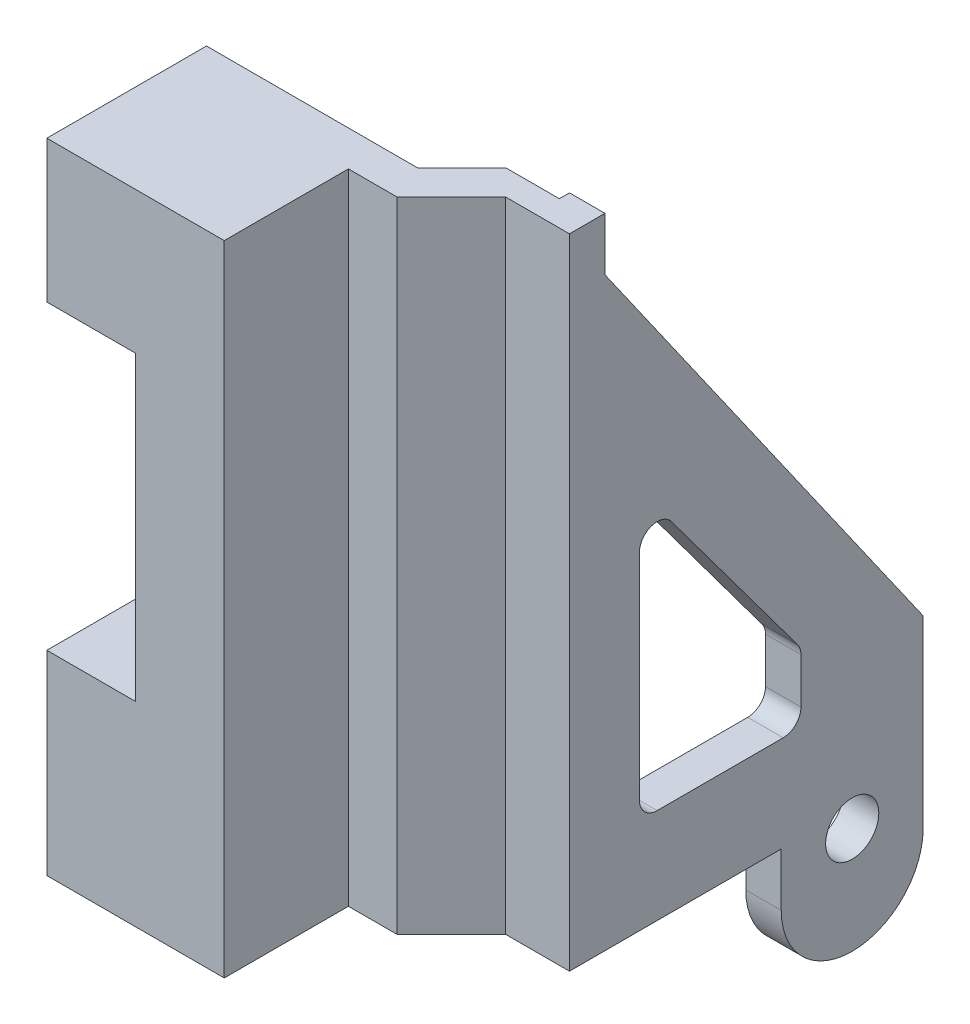
ISO-10303-21;
HEADER;
FILE_DESCRIPTION(('STEP AP214'),'2;1');
FILE_NAME('part.step','',(''),(''),'','','');
FILE_SCHEMA(('AUTOMOTIVE_DESIGN { 1 0 10303 214 1 1 1 1 }'));
ENDSEC;
DATA;
#1=APPLICATION_CONTEXT('core data for automotive mechanical design processes');
#2=APPLICATION_PROTOCOL_DEFINITION('international standard','automotive_design',2000,#1);
#3=PRODUCT_CONTEXT('',#1,'mechanical');
#4=PRODUCT('Part','Part','',(#3));
#5=PRODUCT_RELATED_PRODUCT_CATEGORY('part','',(#4));
#6=PRODUCT_DEFINITION_FORMATION('','',#4);
#7=PRODUCT_DEFINITION_CONTEXT('part definition',#1,'design');
#8=PRODUCT_DEFINITION('design','',#6,#7);
#9=PRODUCT_DEFINITION_SHAPE('','',#8);
#10=(LENGTH_UNIT() NAMED_UNIT(*) SI_UNIT(.MILLI.,.METRE.));
#11=(NAMED_UNIT(*) PLANE_ANGLE_UNIT() SI_UNIT($,.RADIAN.));
#12=(NAMED_UNIT(*) SI_UNIT($,.STERADIAN.) SOLID_ANGLE_UNIT());
#13=UNCERTAINTY_MEASURE_WITH_UNIT(LENGTH_MEASURE(1.E-05),#10,'distance_accuracy_value','');
#14=(GEOMETRIC_REPRESENTATION_CONTEXT(3) GLOBAL_UNCERTAINTY_ASSIGNED_CONTEXT((#13)) GLOBAL_UNIT_ASSIGNED_CONTEXT((#10,
#11,#12)) REPRESENTATION_CONTEXT('',''));
#15=CARTESIAN_POINT('',(0.,0.,0.));
#16=DIRECTION('',(0.,0.,1.));
#17=DIRECTION('',(1.,0.,0.));
#18=AXIS2_PLACEMENT_3D('',#15,#16,#17);
#19=CARTESIAN_POINT('',(0.,36.,0.));
#20=DIRECTION('',(1.,0.,0.));
#21=DIRECTION('',(0.,0.,-1.));
#22=AXIS2_PLACEMENT_3D('',#19,#20,#21);
#23=PLANE('',#22);
#24=DIRECTION('',(0.,-1.,0.));
#25=VECTOR('',#24,1.);
#26=CARTESIAN_POINT('',(0.,36.,9.));
#27=LINE('',#26,#25);
#28=CARTESIAN_POINT('',(0.,11.,9.));
#29=VERTEX_POINT('',#28);
#30=CARTESIAN_POINT('',(0.,0.,9.));
#31=VERTEX_POINT('',#30);
#32=EDGE_CURVE('E44',#29,#31,#27,.T.);
#33=ORIENTED_EDGE('',*,*,#32,.F.);
#34=DIRECTION('',(0.,0.,-1.));
#35=VECTOR('',#34,1.);
#36=CARTESIAN_POINT('',(0.,11.,9.001));
#37=LINE('',#36,#35);
#38=CARTESIAN_POINT('',(0.,11.,0.));
#39=VERTEX_POINT('',#38);
#40=EDGE_CURVE('E226',#29,#39,#37,.T.);
#41=ORIENTED_EDGE('',*,*,#40,.T.);
#42=DIRECTION('',(0.,-1.,0.));
#43=VECTOR('',#42,1.);
#44=CARTESIAN_POINT('',(0.,36.,0.));
#45=LINE('',#44,#43);
#46=CARTESIAN_POINT('',(0.,0.,0.));
#47=VERTEX_POINT('',#46);
#48=EDGE_CURVE('E277',#39,#47,#45,.T.);
#49=ORIENTED_EDGE('',*,*,#48,.T.);
#50=DIRECTION('',(0.,0.,1.));
#51=VECTOR('',#50,1.);
#52=CARTESIAN_POINT('',(0.,0.,0.));
#53=LINE('',#52,#51);
#54=EDGE_CURVE('E278',#47,#31,#53,.T.);
#55=ORIENTED_EDGE('',*,*,#54,.T.);
#56=EDGE_LOOP('',(#33,#41,#49,#55));
#57=FACE_BOUND('',#56,.T.);
#58=ADVANCED_FACE('F36',(#57),#23,.F.);
#59=CARTESIAN_POINT('',(0.,36.,0.));
#60=VERTEX_POINT('',#59);
#61=CARTESIAN_POINT('',(0.,28.,0.));
#62=VERTEX_POINT('',#61);
#63=EDGE_CURVE('E233',#60,#62,#45,.T.);
#64=ORIENTED_EDGE('',*,*,#63,.T.);
#65=DIRECTION('',(0.,0.,-1.));
#66=VECTOR('',#65,1.);
#67=CARTESIAN_POINT('',(0.,28.,9.001));
#68=LINE('',#67,#66);
#69=CARTESIAN_POINT('',(0.,28.,9.));
#70=VERTEX_POINT('',#69);
#71=EDGE_CURVE('E51',#70,#62,#68,.T.);
#72=ORIENTED_EDGE('',*,*,#71,.F.);
#73=CARTESIAN_POINT('',(0.,36.,9.));
#74=VERTEX_POINT('',#73);
#75=EDGE_CURVE('E11',#74,#70,#27,.T.);
#76=ORIENTED_EDGE('',*,*,#75,.F.);
#77=DIRECTION('',(0.,0.,1.));
#78=VECTOR('',#77,1.);
#79=CARTESIAN_POINT('',(0.,36.,0.));
#80=LINE('',#79,#78);
#81=EDGE_CURVE('E245',#60,#74,#80,.T.);
#82=ORIENTED_EDGE('',*,*,#81,.F.);
#83=EDGE_LOOP('',(#64,#72,#76,#82));
#84=FACE_BOUND('',#83,.T.);
#85=ADVANCED_FACE('F38',(#84),#23,.F.);
#86=CARTESIAN_POINT('',(0.,36.,9.));
#87=DIRECTION('',(0.,0.,-1.));
#88=DIRECTION('',(-1.,0.,0.));
#89=AXIS2_PLACEMENT_3D('',#86,#87,#88);
#90=PLANE('',#89);
#91=DIRECTION('',(0.,1.,0.));
#92=VECTOR('',#91,1.);
#93=CARTESIAN_POINT('',(5.,11.,9.));
#94=LINE('',#93,#92);
#95=CARTESIAN_POINT('',(5.,11.,9.));
#96=VERTEX_POINT('',#95);
#97=CARTESIAN_POINT('',(5.,28.,9.));
#98=VERTEX_POINT('',#97);
#99=EDGE_CURVE('E489',#96,#98,#94,.T.);
#100=ORIENTED_EDGE('',*,*,#99,.F.);
#101=DIRECTION('',(1.,0.,0.));
#102=VECTOR('',#101,1.);
#103=CARTESIAN_POINT('',(0.,11.,9.));
#104=LINE('',#103,#102);
#105=EDGE_CURVE('E330',#29,#96,#104,.T.);
#106=ORIENTED_EDGE('',*,*,#105,.F.);
#107=ORIENTED_EDGE('',*,*,#32,.T.);
#108=DIRECTION('',(1.,0.,0.));
#109=VECTOR('',#108,1.);
#110=CARTESIAN_POINT('',(0.,0.,9.));
#111=LINE('',#110,#109);
#112=CARTESIAN_POINT('',(10.,0.,9.));
#113=VERTEX_POINT('',#112);
#114=EDGE_CURVE('E281',#31,#113,#111,.T.);
#115=ORIENTED_EDGE('',*,*,#114,.T.);
#116=DIRECTION('',(0.,-1.,0.));
#117=VECTOR('',#116,1.);
#118=CARTESIAN_POINT('',(10.,36.,9.));
#119=LINE('',#118,#117);
#120=CARTESIAN_POINT('',(10.,36.,9.));
#121=VERTEX_POINT('',#120);
#122=EDGE_CURVE('E241',#121,#113,#119,.T.);
#123=ORIENTED_EDGE('',*,*,#122,.F.);
#124=DIRECTION('',(1.,0.,0.));
#125=VECTOR('',#124,1.);
#126=CARTESIAN_POINT('',(0.,36.,9.));
#127=LINE('',#126,#125);
#128=EDGE_CURVE('E238',#74,#121,#127,.T.);
#129=ORIENTED_EDGE('',*,*,#128,.F.);
#130=ORIENTED_EDGE('',*,*,#75,.T.);
#131=DIRECTION('',(-1.,0.,0.));
#132=VECTOR('',#131,1.);
#133=CARTESIAN_POINT('',(5.,28.,9.));
#134=LINE('',#133,#132);
#135=EDGE_CURVE('E220',#98,#70,#134,.T.);
#136=ORIENTED_EDGE('',*,*,#135,.F.);
#137=EDGE_LOOP('',(#100,#106,#107,#115,#123,#129,#130,#136));
#138=FACE_BOUND('',#137,.T.);
#139=ADVANCED_FACE('F236',(#138),#90,.F.);
#140=CARTESIAN_POINT('',(10.,36.,9.));
#141=DIRECTION('',(-1.,0.,0.));
#142=DIRECTION('',(0.,0.,1.));
#143=AXIS2_PLACEMENT_3D('',#140,#141,#142);
#144=PLANE('',#143);
#145=DIRECTION('',(0.,0.,-1.));
#146=VECTOR('',#145,1.);
#147=CARTESIAN_POINT('',(10.,0.,9.));
#148=LINE('',#147,#146);
#149=CARTESIAN_POINT('',(10.,0.,2.));
#150=VERTEX_POINT('',#149);
#151=EDGE_CURVE('E283',#113,#150,#148,.T.);
#152=ORIENTED_EDGE('',*,*,#151,.T.);
#153=DIRECTION('',(0.,-1.,0.));
#154=VECTOR('',#153,1.);
#155=CARTESIAN_POINT('',(10.,36.,2.));
#156=LINE('',#155,#154);
#157=CARTESIAN_POINT('',(10.,36.,2.));
#158=VERTEX_POINT('',#157);
#159=EDGE_CURVE('E322',#158,#150,#156,.T.);
#160=ORIENTED_EDGE('',*,*,#159,.F.);
#161=DIRECTION('',(0.,0.,-1.));
#162=VECTOR('',#161,1.);
#163=CARTESIAN_POINT('',(10.,36.,9.));
#164=LINE('',#163,#162);
#165=EDGE_CURVE('E244',#121,#158,#164,.T.);
#166=ORIENTED_EDGE('',*,*,#165,.F.);
#167=ORIENTED_EDGE('',*,*,#122,.T.);
#168=EDGE_LOOP('',(#152,#160,#166,#167));
#169=FACE_BOUND('',#168,.T.);
#170=ADVANCED_FACE('F388',(#169),#144,.F.);
#171=CARTESIAN_POINT('',(10.,36.,2.));
#172=DIRECTION('',(0.,0.,-1.));
#173=DIRECTION('',(-1.,0.,0.));
#174=AXIS2_PLACEMENT_3D('',#171,#172,#173);
#175=PLANE('',#174);
#176=DIRECTION('',(1.,0.,0.));
#177=VECTOR('',#176,1.);
#178=CARTESIAN_POINT('',(10.,0.,2.));
#179=LINE('',#178,#177);
#180=CARTESIAN_POINT('',(12.7380952380952,0.,2.));
#181=VERTEX_POINT('',#180);
#182=EDGE_CURVE('E285',#150,#181,#179,.T.);
#183=ORIENTED_EDGE('',*,*,#182,.T.);
#184=DIRECTION('',(0.,-1.,0.));
#185=VECTOR('',#184,1.);
#186=CARTESIAN_POINT('',(12.7380952380952,36.,2.));
#187=LINE('',#186,#185);
#188=CARTESIAN_POINT('',(12.7380952380952,36.,2.));
#189=VERTEX_POINT('',#188);
#190=EDGE_CURVE('E319',#189,#181,#187,.T.);
#191=ORIENTED_EDGE('',*,*,#190,.F.);
#192=DIRECTION('',(1.,0.,0.));
#193=VECTOR('',#192,1.);
#194=CARTESIAN_POINT('',(10.,36.,2.));
#195=LINE('',#194,#193);
#196=EDGE_CURVE('E261',#158,#189,#195,.T.);
#197=ORIENTED_EDGE('',*,*,#196,.F.);
#198=ORIENTED_EDGE('',*,*,#159,.T.);
#199=EDGE_LOOP('',(#183,#191,#197,#198));
#200=FACE_BOUND('',#199,.T.);
#201=ADVANCED_FACE('F386',(#200),#175,.F.);
#202=CARTESIAN_POINT('',(12.7380952380952,36.,2.));
#203=DIRECTION('',(-0.707106781186548,0.,-0.707106781186546));
#204=DIRECTION('',(-0.707106781186546,0.,0.707106781186549));
#205=AXIS2_PLACEMENT_3D('',#202,#203,#204);
#206=PLANE('',#205);
#207=DIRECTION('',(0.707106781186546,0.,-0.707106781186549));
#208=VECTOR('',#207,1.);
#209=CARTESIAN_POINT('',(12.7380952380952,0.,2.));
#210=LINE('',#209,#208);
#211=CARTESIAN_POINT('',(15.7993197278912,0.,-1.06122448979593));
#212=VERTEX_POINT('',#211);
#213=EDGE_CURVE('E287',#181,#212,#210,.T.);
#214=ORIENTED_EDGE('',*,*,#213,.T.);
#215=DIRECTION('',(0.,-1.,0.));
#216=VECTOR('',#215,1.);
#217=CARTESIAN_POINT('',(15.7993197278912,36.,-1.06122448979593));
#218=LINE('',#217,#216);
#219=CARTESIAN_POINT('',(15.7993197278912,36.,-1.06122448979593));
#220=VERTEX_POINT('',#219);
#221=EDGE_CURVE('E316',#220,#212,#218,.T.);
#222=ORIENTED_EDGE('',*,*,#221,.F.);
#223=DIRECTION('',(0.707106781186546,0.,-0.707106781186549));
#224=VECTOR('',#223,1.);
#225=CARTESIAN_POINT('',(12.7380952380952,36.,2.));
#226=LINE('',#225,#224);
#227=EDGE_CURVE('E263',#189,#220,#226,.T.);
#228=ORIENTED_EDGE('',*,*,#227,.F.);
#229=ORIENTED_EDGE('',*,*,#190,.T.);
#230=EDGE_LOOP('',(#214,#222,#228,#229));
#231=FACE_BOUND('',#230,.T.);
#232=ADVANCED_FACE('F381',(#231),#206,.F.);
#233=CARTESIAN_POINT('',(15.7993197278912,36.,-1.06122448979593));
#234=DIRECTION('',(0.,0.,-1.));
#235=DIRECTION('',(-1.,0.,0.));
#236=AXIS2_PLACEMENT_3D('',#233,#234,#235);
#237=PLANE('',#236);
#238=DIRECTION('',(1.,0.,0.));
#239=VECTOR('',#238,1.);
#240=CARTESIAN_POINT('',(15.7993197278912,0.,-1.06122448979593));
#241=LINE('',#240,#239);
#242=CARTESIAN_POINT('',(19.3993197278912,0.,-1.06122448979593));
#243=VERTEX_POINT('',#242);
#244=EDGE_CURVE('E289',#212,#243,#241,.T.);
#245=ORIENTED_EDGE('',*,*,#244,.T.);
#246=DIRECTION('',(0.,-1.,0.));
#247=VECTOR('',#246,1.);
#248=CARTESIAN_POINT('',(19.3993197278912,36.,-1.06122448979593));
#249=LINE('',#248,#247);
#250=CARTESIAN_POINT('',(19.3993197278912,36.,-1.06122448979593));
#251=VERTEX_POINT('',#250);
#252=EDGE_CURVE('E313',#251,#243,#249,.T.);
#253=ORIENTED_EDGE('',*,*,#252,.F.);
#254=DIRECTION('',(1.,0.,0.));
#255=VECTOR('',#254,1.);
#256=CARTESIAN_POINT('',(15.7993197278912,36.,-1.06122448979593));
#257=LINE('',#256,#255);
#258=EDGE_CURVE('E265',#220,#251,#257,.T.);
#259=ORIENTED_EDGE('',*,*,#258,.F.);
#260=ORIENTED_EDGE('',*,*,#221,.T.);
#261=EDGE_LOOP('',(#245,#253,#259,#260));
#262=FACE_BOUND('',#261,.T.);
#263=ADVANCED_FACE('F377',(#262),#237,.F.);
#264=CARTESIAN_POINT('',(19.3993197278912,36.,-1.06122448979593));
#265=DIRECTION('',(-1.,0.,0.));
#266=DIRECTION('',(0.,0.,1.));
#267=AXIS2_PLACEMENT_3D('',#264,#265,#266);
#268=PLANE('',#267);
#269=CARTESIAN_POINT('',(19.3993197278912,-1.,-17.));
#270=DIRECTION('',(1.,0.,0.));
#271=DIRECTION('',(0.,0.,-1.));
#272=AXIS2_PLACEMENT_3D('',#269,#270,#271);
#273=CIRCLE('',#272,1.5);
#274=CARTESIAN_POINT('',(19.3993197278912,-1.,-18.5));
#275=VERTEX_POINT('',#274);
#276=EDGE_CURVE('E494',#275,#275,#273,.T.);
#277=ORIENTED_EDGE('',*,*,#276,.F.);
#278=EDGE_LOOP('',(#277));
#279=FACE_BOUND('',#278,.T.);
#280=DIRECTION('',(0.,0.,-1.));
#281=VECTOR('',#280,1.);
#282=CARTESIAN_POINT('',(19.3993197278912,5.37060442331949,-13.1122493749322));
#283=LINE('',#282,#281);
#284=CARTESIAN_POINT('',(19.3993197278912,5.37060442331949,-6.00678721245152));
#285=VERTEX_POINT('',#284);
#286=CARTESIAN_POINT('',(19.3993197278912,5.37060442331949,-13.1122493749322));
#287=VERTEX_POINT('',#286);
#288=EDGE_CURVE('E443',#285,#287,#283,.T.);
#289=ORIENTED_EDGE('',*,*,#288,.F.);
#290=CARTESIAN_POINT('',(19.3993197278912,6.37060442331949,-6.00678721245152));
#291=DIRECTION('',(1.,0.,0.));
#292=DIRECTION('',(0.,0.,1.));
#293=AXIS2_PLACEMENT_3D('',#290,#291,#292);
#294=CIRCLE('',#293,1.);
#295=CARTESIAN_POINT('',(19.3993197278912,6.3706044233195,-5.00678721245152));
#296=VERTEX_POINT('',#295);
#297=EDGE_CURVE('E446',#296,#285,#294,.T.);
#298=ORIENTED_EDGE('',*,*,#297,.F.);
#299=DIRECTION('',(0.,-1.,0.));
#300=VECTOR('',#299,1.);
#301=CARTESIAN_POINT('',(19.3993197278912,6.3706044233195,-5.00678721245152));
#302=LINE('',#301,#300);
#303=CARTESIAN_POINT('',(19.3993197278912,18.4783838164461,-5.00678721245152));
#304=VERTEX_POINT('',#303);
#305=EDGE_CURVE('E413',#304,#296,#302,.T.);
#306=ORIENTED_EDGE('',*,*,#305,.F.);
#307=CARTESIAN_POINT('',(19.3993197278912,18.4783838164462,-6.00678721245152));
#308=DIRECTION('',(1.,0.,0.));
#309=DIRECTION('',(0.,0.,-1.));
#310=AXIS2_PLACEMENT_3D('',#307,#308,#309);
#311=CIRCLE('',#310,1.);
#312=CARTESIAN_POINT('',(19.3993197278912,19.0751252893793,-6.80922077012566));
#313=VERTEX_POINT('',#312);
#314=EDGE_CURVE('E428',#313,#304,#311,.T.);
#315=ORIENTED_EDGE('',*,*,#314,.F.);
#316=DIRECTION('',(0.,0.802433557674125,0.596741472933168));
#317=VECTOR('',#316,1.);
#318=CARTESIAN_POINT('',(19.3993197278912,19.0751252893793,-6.80922077012566));
#319=LINE('',#318,#317);
#320=CARTESIAN_POINT('',(19.3993197278912,9.52046629453387,-13.9146829326063));
#321=VERTEX_POINT('',#320);
#322=EDGE_CURVE('E431',#321,#313,#319,.T.);
#323=ORIENTED_EDGE('',*,*,#322,.F.);
#324=CARTESIAN_POINT('',(19.3993197278912,8.9237248216007,-13.1122493749322));
#325=DIRECTION('',(1.,0.,0.));
#326=DIRECTION('',(0.,0.,1.));
#327=AXIS2_PLACEMENT_3D('',#324,#325,#326);
#328=CIRCLE('',#327,1.);
#329=CARTESIAN_POINT('',(19.3993197278912,8.9237248216007,-14.1122493749322));
#330=VERTEX_POINT('',#329);
#331=EDGE_CURVE('E434',#330,#321,#328,.T.);
#332=ORIENTED_EDGE('',*,*,#331,.F.);
#333=DIRECTION('',(0.,1.,0.));
#334=VECTOR('',#333,1.);
#335=CARTESIAN_POINT('',(19.3993197278912,8.9237248216007,-14.1122493749322));
#336=LINE('',#335,#334);
#337=CARTESIAN_POINT('',(19.3993197278912,6.3706044233195,-14.1122493749322));
#338=VERTEX_POINT('',#337);
#339=EDGE_CURVE('E437',#338,#330,#336,.T.);
#340=ORIENTED_EDGE('',*,*,#339,.F.);
#341=CARTESIAN_POINT('',(19.3993197278912,6.37060442331949,-13.1122493749322));
#342=DIRECTION('',(1.,0.,0.));
#343=DIRECTION('',(0.,0.,1.));
#344=AXIS2_PLACEMENT_3D('',#341,#342,#343);
#345=CIRCLE('',#344,1.);
#346=EDGE_CURVE('E440',#287,#338,#345,.T.);
#347=ORIENTED_EDGE('',*,*,#346,.F.);
#348=EDGE_LOOP('',(#289,#298,#306,#315,#323,#332,#340,#347));
#349=FACE_BOUND('',#348,.T.);
#350=DIRECTION('',(0.,-1.,0.));
#351=VECTOR('',#350,1.);
#352=CARTESIAN_POINT('',(19.3993197278912,36.,-21.));
#353=LINE('',#352,#351);
#354=CARTESIAN_POINT('',(19.3993197278912,7.38077351170788,-21.));
#355=VERTEX_POINT('',#354);
#356=CARTESIAN_POINT('',(19.3993197278912,-3.,-21.));
#357=VERTEX_POINT('',#356);
#358=EDGE_CURVE('E311',#355,#357,#353,.T.);
#359=ORIENTED_EDGE('',*,*,#358,.F.);
#360=DIRECTION('',(0.,-0.819152044288991,-0.573576436351047));
#361=VECTOR('',#360,1.);
#362=CARTESIAN_POINT('',(19.3993197278912,33.,-3.06122448979593));
#363=LINE('',#362,#361);
#364=CARTESIAN_POINT('',(19.3993197278912,33.,-3.06122448979593));
#365=VERTEX_POINT('',#364);
#366=EDGE_CURVE('E393',#365,#355,#363,.T.);
#367=ORIENTED_EDGE('',*,*,#366,.F.);
#368=DIRECTION('',(0.,-1.,0.));
#369=VECTOR('',#368,1.);
#370=CARTESIAN_POINT('',(19.3993197278912,36.,-3.06122448979593));
#371=LINE('',#370,#369);
#372=CARTESIAN_POINT('',(19.3993197278912,36.,-3.06122448979593));
#373=VERTEX_POINT('',#372);
#374=EDGE_CURVE('E396',#373,#365,#371,.T.);
#375=ORIENTED_EDGE('',*,*,#374,.F.);
#376=DIRECTION('',(0.,0.,-1.));
#377=VECTOR('',#376,1.);
#378=CARTESIAN_POINT('',(19.3993197278912,36.,-1.06122448979593));
#379=LINE('',#378,#377);
#380=EDGE_CURVE('E267',#251,#373,#379,.T.);
#381=ORIENTED_EDGE('',*,*,#380,.F.);
#382=ORIENTED_EDGE('',*,*,#252,.T.);
#383=DIRECTION('',(0.,0.,-1.));
#384=VECTOR('',#383,1.);
#385=CARTESIAN_POINT('',(19.3993197278912,0.,-1.06122448979593));
#386=LINE('',#385,#384);
#387=CARTESIAN_POINT('',(19.3993197278912,0.,-13.));
#388=VERTEX_POINT('',#387);
#389=EDGE_CURVE('E291',#243,#388,#386,.T.);
#390=ORIENTED_EDGE('',*,*,#389,.T.);
#391=DIRECTION('',(0.,-1.,0.));
#392=VECTOR('',#391,1.);
#393=CARTESIAN_POINT('',(19.3993197278912,0.,-13.));
#394=LINE('',#393,#392);
#395=CARTESIAN_POINT('',(19.3993197278912,-3.,-13.));
#396=VERTEX_POINT('',#395);
#397=EDGE_CURVE('E59',#388,#396,#394,.T.);
#398=ORIENTED_EDGE('',*,*,#397,.T.);
#399=CARTESIAN_POINT('',(19.3993197278912,-3.,-17.));
#400=DIRECTION('',(1.,0.,0.));
#401=DIRECTION('',(0.,0.,1.));
#402=AXIS2_PLACEMENT_3D('',#399,#400,#401);
#403=CIRCLE('',#402,4.);
#404=EDGE_CURVE('E472',#396,#357,#403,.T.);
#405=ORIENTED_EDGE('',*,*,#404,.T.);
#406=EDGE_LOOP('',(#359,#367,#375,#381,#382,#390,#398,#405));
#407=FACE_BOUND('',#406,.T.);
#408=ADVANCED_FACE('F370',(#279,#349,#407),#268,.F.);
#409=CARTESIAN_POINT('',(19.3993197278912,36.,-21.));
#410=DIRECTION('',(0.,0.,1.));
#411=DIRECTION('',(1.,0.,0.));
#412=AXIS2_PLACEMENT_3D('',#409,#410,#411);
#413=PLANE('',#412);
#414=DIRECTION('',(0.,-1.,0.));
#415=VECTOR('',#414,1.);
#416=CARTESIAN_POINT('',(17.3993197278912,36.,-21.));
#417=LINE('',#416,#415);
#418=CARTESIAN_POINT('',(17.3993197278912,7.38077351170788,-21.));
#419=VERTEX_POINT('',#418);
#420=CARTESIAN_POINT('',(17.3993197278912,-3.,-21.));
#421=VERTEX_POINT('',#420);
#422=EDGE_CURVE('E309',#419,#421,#417,.T.);
#423=ORIENTED_EDGE('',*,*,#422,.F.);
#424=DIRECTION('',(1.,0.,0.));
#425=VECTOR('',#424,1.);
#426=CARTESIAN_POINT('',(-0.00100000000000794,7.38077351170788,-21.));
#427=LINE('',#426,#425);
#428=EDGE_CURVE('E394',#419,#355,#427,.T.);
#429=ORIENTED_EDGE('',*,*,#428,.T.);
#430=ORIENTED_EDGE('',*,*,#358,.T.);
#431=DIRECTION('',(1.,0.,0.));
#432=VECTOR('',#431,1.);
#433=CARTESIAN_POINT('',(17.3993197278912,-3.,-21.));
#434=LINE('',#433,#432);
#435=EDGE_CURVE('E467',#421,#357,#434,.T.);
#436=ORIENTED_EDGE('',*,*,#435,.F.);
#437=EDGE_LOOP('',(#423,#429,#430,#436));
#438=FACE_BOUND('',#437,.T.);
#439=ADVANCED_FACE('F503',(#438),#413,.F.);
#440=CARTESIAN_POINT('',(17.3993197278912,36.,-2.48965161454213));
#441=DIRECTION('',(1.,0.,0.));
#442=DIRECTION('',(0.,0.,-1.));
#443=AXIS2_PLACEMENT_3D('',#440,#441,#442);
#444=PLANE('',#443);
#445=CARTESIAN_POINT('',(17.3993197278912,-1.,-17.));
#446=DIRECTION('',(1.,0.,0.));
#447=DIRECTION('',(0.,0.,-1.));
#448=AXIS2_PLACEMENT_3D('',#445,#446,#447);
#449=CIRCLE('',#448,1.5);
#450=CARTESIAN_POINT('',(17.3993197278912,-1.,-18.5));
#451=VERTEX_POINT('',#450);
#452=EDGE_CURVE('E491',#451,#451,#449,.F.);
#453=ORIENTED_EDGE('',*,*,#452,.F.);
#454=EDGE_LOOP('',(#453));
#455=FACE_BOUND('',#454,.T.);
#456=DIRECTION('',(0.,1.,0.));
#457=VECTOR('',#456,1.);
#458=CARTESIAN_POINT('',(17.3993197278912,6.3706044233195,-5.00678721245152));
#459=LINE('',#458,#457);
#460=CARTESIAN_POINT('',(17.3993197278912,6.3706044233195,-5.00678721245152));
#461=VERTEX_POINT('',#460);
#462=CARTESIAN_POINT('',(17.3993197278912,18.4783838164461,-5.00678721245152));
#463=VERTEX_POINT('',#462);
#464=EDGE_CURVE('E451',#461,#463,#459,.T.);
#465=ORIENTED_EDGE('',*,*,#464,.F.);
#466=CARTESIAN_POINT('',(17.3993197278912,6.37060442331949,-6.00678721245152));
#467=DIRECTION('',(1.,0.,0.));
#468=DIRECTION('',(0.,0.,-1.));
#469=AXIS2_PLACEMENT_3D('',#466,#467,#468);
#470=CIRCLE('',#469,1.);
#471=CARTESIAN_POINT('',(17.3993197278912,5.37060442331949,-6.00678721245152));
#472=VERTEX_POINT('',#471);
#473=EDGE_CURVE('E448',#472,#461,#470,.F.);
#474=ORIENTED_EDGE('',*,*,#473,.F.);
#475=DIRECTION('',(0.,0.,1.));
#476=VECTOR('',#475,1.);
#477=CARTESIAN_POINT('',(17.3993197278912,5.37060442331949,-13.1122493749322));
#478=LINE('',#477,#476);
#479=CARTESIAN_POINT('',(17.3993197278912,5.37060442331949,-13.1122493749322));
#480=VERTEX_POINT('',#479);
#481=EDGE_CURVE('E405',#480,#472,#478,.T.);
#482=ORIENTED_EDGE('',*,*,#481,.F.);
#483=CARTESIAN_POINT('',(17.3993197278912,6.37060442331949,-13.1122493749322));
#484=DIRECTION('',(1.,0.,0.));
#485=DIRECTION('',(0.,0.,-1.));
#486=AXIS2_PLACEMENT_3D('',#483,#484,#485);
#487=CIRCLE('',#486,1.);
#488=CARTESIAN_POINT('',(17.3993197278912,6.3706044233195,-14.1122493749322));
#489=VERTEX_POINT('',#488);
#490=EDGE_CURVE('E466',#489,#480,#487,.F.);
#491=ORIENTED_EDGE('',*,*,#490,.F.);
#492=DIRECTION('',(0.,-1.,0.));
#493=VECTOR('',#492,1.);
#494=CARTESIAN_POINT('',(17.3993197278912,8.9237248216007,-14.1122493749322));
#495=LINE('',#494,#493);
#496=CARTESIAN_POINT('',(17.3993197278912,8.9237248216007,-14.1122493749322));
#497=VERTEX_POINT('',#496);
#498=EDGE_CURVE('E463',#497,#489,#495,.T.);
#499=ORIENTED_EDGE('',*,*,#498,.F.);
#500=CARTESIAN_POINT('',(17.3993197278912,8.9237248216007,-13.1122493749322));
#501=DIRECTION('',(1.,0.,0.));
#502=DIRECTION('',(0.,0.,-1.));
#503=AXIS2_PLACEMENT_3D('',#500,#501,#502);
#504=CIRCLE('',#503,1.);
#505=CARTESIAN_POINT('',(17.3993197278912,9.52046629453387,-13.9146829326063));
#506=VERTEX_POINT('',#505);
#507=EDGE_CURVE('E460',#506,#497,#504,.F.);
#508=ORIENTED_EDGE('',*,*,#507,.F.);
#509=DIRECTION('',(0.,-0.802433557674125,-0.596741472933168));
#510=VECTOR('',#509,1.);
#511=CARTESIAN_POINT('',(17.3993197278912,19.0751252893793,-6.80922077012566));
#512=LINE('',#511,#510);
#513=CARTESIAN_POINT('',(17.3993197278912,19.0751252893793,-6.80922077012566));
#514=VERTEX_POINT('',#513);
#515=EDGE_CURVE('E457',#514,#506,#512,.T.);
#516=ORIENTED_EDGE('',*,*,#515,.F.);
#517=CARTESIAN_POINT('',(17.3993197278912,18.4783838164462,-6.00678721245152));
#518=DIRECTION('',(1.,0.,0.));
#519=DIRECTION('',(0.,0.,-1.));
#520=AXIS2_PLACEMENT_3D('',#517,#518,#519);
#521=CIRCLE('',#520,1.);
#522=EDGE_CURVE('E454',#463,#514,#521,.F.);
#523=ORIENTED_EDGE('',*,*,#522,.F.);
#524=EDGE_LOOP('',(#465,#474,#482,#491,#499,#508,#516,#523));
#525=FACE_BOUND('',#524,.T.);
#526=DIRECTION('',(0.,1.,0.));
#527=VECTOR('',#526,1.);
#528=CARTESIAN_POINT('',(17.3993197278912,36.,-3.06122448979593));
#529=LINE('',#528,#527);
#530=CARTESIAN_POINT('',(17.3993197278912,33.,-3.06122448979593));
#531=VERTEX_POINT('',#530);
#532=CARTESIAN_POINT('',(17.3993197278912,36.,-3.06122448979593));
#533=VERTEX_POINT('',#532);
#534=EDGE_CURVE('E257',#531,#533,#529,.T.);
#535=ORIENTED_EDGE('',*,*,#534,.F.);
#536=DIRECTION('',(0.,0.819152044288991,0.573576436351047));
#537=VECTOR('',#536,1.);
#538=CARTESIAN_POINT('',(17.3993197278912,33.,-3.06122448979593));
#539=LINE('',#538,#537);
#540=EDGE_CURVE('E402',#419,#531,#539,.T.);
#541=ORIENTED_EDGE('',*,*,#540,.F.);
#542=ORIENTED_EDGE('',*,*,#422,.T.);
#543=CARTESIAN_POINT('',(17.3993197278912,-3.,-17.));
#544=DIRECTION('',(1.,0.,0.));
#545=DIRECTION('',(0.,0.,1.));
#546=AXIS2_PLACEMENT_3D('',#543,#544,#545);
#547=CIRCLE('',#546,4.);
#548=CARTESIAN_POINT('',(17.3993197278912,-3.,-13.));
#549=VERTEX_POINT('',#548);
#550=EDGE_CURVE('E366',#549,#421,#547,.T.);
#551=ORIENTED_EDGE('',*,*,#550,.F.);
#552=DIRECTION('',(0.,-1.,0.));
#553=VECTOR('',#552,1.);
#554=CARTESIAN_POINT('',(17.3993197278912,0.,-13.));
#555=LINE('',#554,#553);
#556=CARTESIAN_POINT('',(17.3993197278912,0.,-13.));
#557=VERTEX_POINT('',#556);
#558=EDGE_CURVE('E361',#557,#549,#555,.T.);
#559=ORIENTED_EDGE('',*,*,#558,.F.);
#560=DIRECTION('',(0.,0.,1.));
#561=VECTOR('',#560,1.);
#562=CARTESIAN_POINT('',(17.3993197278912,0.,-2.48965161454213));
#563=LINE('',#562,#561);
#564=CARTESIAN_POINT('',(17.3993197278912,0.,-2.48965161454213));
#565=VERTEX_POINT('',#564);
#566=EDGE_CURVE('E294',#557,#565,#563,.T.);
#567=ORIENTED_EDGE('',*,*,#566,.T.);
#568=DIRECTION('',(0.,-1.,0.));
#569=VECTOR('',#568,1.);
#570=CARTESIAN_POINT('',(17.3993197278912,36.,-2.48965161454213));
#571=LINE('',#570,#569);
#572=CARTESIAN_POINT('',(17.3993197278912,36.,-2.48965161454213));
#573=VERTEX_POINT('',#572);
#574=EDGE_CURVE('E306',#573,#565,#571,.T.);
#575=ORIENTED_EDGE('',*,*,#574,.F.);
#576=DIRECTION('',(0.,0.,1.));
#577=VECTOR('',#576,1.);
#578=CARTESIAN_POINT('',(17.3993197278912,36.,-2.48965161454213));
#579=LINE('',#578,#577);
#580=EDGE_CURVE('E270',#533,#573,#579,.T.);
#581=ORIENTED_EDGE('',*,*,#580,.F.);
#582=EDGE_LOOP('',(#535,#541,#542,#551,#559,#567,#575,#581));
#583=FACE_BOUND('',#582,.T.);
#584=ADVANCED_FACE('F357',(#455,#525,#583),#444,.F.);
#585=CARTESIAN_POINT('',(14.3993197278912,36.,-2.48965161454213));
#586=DIRECTION('',(0.,0.,1.));
#587=DIRECTION('',(1.,0.,0.));
#588=AXIS2_PLACEMENT_3D('',#585,#586,#587);
#589=PLANE('',#588);
#590=DIRECTION('',(-1.,0.,0.));
#591=VECTOR('',#590,1.);
#592=CARTESIAN_POINT('',(14.3993197278912,0.,-2.48965161454213));
#593=LINE('',#592,#591);
#594=CARTESIAN_POINT('',(14.3993197278912,0.,-2.48965161454213));
#595=VERTEX_POINT('',#594);
#596=EDGE_CURVE('E296',#565,#595,#593,.T.);
#597=ORIENTED_EDGE('',*,*,#596,.T.);
#598=DIRECTION('',(0.,-1.,0.));
#599=VECTOR('',#598,1.);
#600=CARTESIAN_POINT('',(14.3993197278912,36.,-2.48965161454213));
#601=LINE('',#600,#599);
#602=CARTESIAN_POINT('',(14.3993197278912,36.,-2.48965161454213));
#603=VERTEX_POINT('',#602);
#604=EDGE_CURVE('E303',#603,#595,#601,.T.);
#605=ORIENTED_EDGE('',*,*,#604,.F.);
#606=DIRECTION('',(-1.,0.,0.));
#607=VECTOR('',#606,1.);
#608=CARTESIAN_POINT('',(14.3993197278912,36.,-2.48965161454213));
#609=LINE('',#608,#607);
#610=EDGE_CURVE('E272',#573,#603,#609,.T.);
#611=ORIENTED_EDGE('',*,*,#610,.F.);
#612=ORIENTED_EDGE('',*,*,#574,.T.);
#613=EDGE_LOOP('',(#597,#605,#611,#612));
#614=FACE_BOUND('',#613,.T.);
#615=ADVANCED_FACE('F352',(#614),#589,.F.);
#616=CARTESIAN_POINT('',(11.909668113349,36.,0.));
#617=DIRECTION('',(0.707106781186549,0.,0.707106781186546));
#618=DIRECTION('',(0.707106781186546,0.,-0.707106781186549));
#619=AXIS2_PLACEMENT_3D('',#616,#617,#618);
#620=PLANE('',#619);
#621=DIRECTION('',(-0.707106781186546,0.,0.707106781186549));
#622=VECTOR('',#621,1.);
#623=CARTESIAN_POINT('',(11.909668113349,0.,0.));
#624=LINE('',#623,#622);
#625=CARTESIAN_POINT('',(11.909668113349,0.,0.));
#626=VERTEX_POINT('',#625);
#627=EDGE_CURVE('E254',#595,#626,#624,.T.);
#628=ORIENTED_EDGE('',*,*,#627,.T.);
#629=DIRECTION('',(0.,-1.,0.));
#630=VECTOR('',#629,1.);
#631=CARTESIAN_POINT('',(11.909668113349,36.,0.));
#632=LINE('',#631,#630);
#633=CARTESIAN_POINT('',(11.909668113349,36.,0.));
#634=VERTEX_POINT('',#633);
#635=EDGE_CURVE('E300',#634,#626,#632,.T.);
#636=ORIENTED_EDGE('',*,*,#635,.F.);
#637=DIRECTION('',(-0.707106781186546,0.,0.707106781186549));
#638=VECTOR('',#637,1.);
#639=CARTESIAN_POINT('',(11.909668113349,36.,0.));
#640=LINE('',#639,#638);
#641=EDGE_CURVE('E274',#603,#634,#640,.T.);
#642=ORIENTED_EDGE('',*,*,#641,.F.);
#643=ORIENTED_EDGE('',*,*,#604,.T.);
#644=EDGE_LOOP('',(#628,#636,#642,#643));
#645=FACE_BOUND('',#644,.T.);
#646=ADVANCED_FACE('F347',(#645),#620,.F.);
#647=CARTESIAN_POINT('',(0.,36.,0.));
#648=DIRECTION('',(0.,0.,1.));
#649=DIRECTION('',(1.,0.,0.));
#650=AXIS2_PLACEMENT_3D('',#647,#648,#649);
#651=PLANE('',#650);
#652=ORIENTED_EDGE('',*,*,#48,.F.);
#653=DIRECTION('',(-1.,0.,0.));
#654=VECTOR('',#653,1.);
#655=CARTESIAN_POINT('',(0.,11.,0.));
#656=LINE('',#655,#654);
#657=CARTESIAN_POINT('',(5.,11.,0.));
#658=VERTEX_POINT('',#657);
#659=EDGE_CURVE('E234',#658,#39,#656,.T.);
#660=ORIENTED_EDGE('',*,*,#659,.F.);
#661=DIRECTION('',(0.,-1.,0.));
#662=VECTOR('',#661,1.);
#663=CARTESIAN_POINT('',(5.,11.,0.));
#664=LINE('',#663,#662);
#665=CARTESIAN_POINT('',(5.,28.,0.));
#666=VERTEX_POINT('',#665);
#667=EDGE_CURVE('E483',#666,#658,#664,.T.);
#668=ORIENTED_EDGE('',*,*,#667,.F.);
#669=DIRECTION('',(1.,0.,0.));
#670=VECTOR('',#669,1.);
#671=CARTESIAN_POINT('',(5.,28.,0.));
#672=LINE('',#671,#670);
#673=EDGE_CURVE('E486',#62,#666,#672,.T.);
#674=ORIENTED_EDGE('',*,*,#673,.F.);
#675=ORIENTED_EDGE('',*,*,#63,.F.);
#676=DIRECTION('',(-1.,0.,0.));
#677=VECTOR('',#676,1.);
#678=CARTESIAN_POINT('',(0.,36.,0.));
#679=LINE('',#678,#677);
#680=EDGE_CURVE('E250',#634,#60,#679,.T.);
#681=ORIENTED_EDGE('',*,*,#680,.F.);
#682=ORIENTED_EDGE('',*,*,#635,.T.);
#683=DIRECTION('',(-1.,0.,0.));
#684=VECTOR('',#683,1.);
#685=CARTESIAN_POINT('',(0.,0.,0.));
#686=LINE('',#685,#684);
#687=EDGE_CURVE('E251',#626,#47,#686,.T.);
#688=ORIENTED_EDGE('',*,*,#687,.T.);
#689=EDGE_LOOP('',(#652,#660,#668,#674,#675,#681,#682,#688));
#690=FACE_BOUND('',#689,.T.);
#691=ADVANCED_FACE('F342',(#690),#651,.F.);
#692=CARTESIAN_POINT('',(0.,36.,0.));
#693=DIRECTION('',(0.,1.,0.));
#694=DIRECTION('',(0.,0.,1.));
#695=AXIS2_PLACEMENT_3D('',#692,#693,#694);
#696=PLANE('',#695);
#697=DIRECTION('',(1.,0.,0.));
#698=VECTOR('',#697,1.);
#699=CARTESIAN_POINT('',(-0.00100000000000447,36.,-3.06122448979593));
#700=LINE('',#699,#698);
#701=EDGE_CURVE('E389',#533,#373,#700,.T.);
#702=ORIENTED_EDGE('',*,*,#701,.F.);
#703=ORIENTED_EDGE('',*,*,#580,.T.);
#704=ORIENTED_EDGE('',*,*,#610,.T.);
#705=ORIENTED_EDGE('',*,*,#641,.T.);
#706=ORIENTED_EDGE('',*,*,#680,.T.);
#707=ORIENTED_EDGE('',*,*,#81,.T.);
#708=ORIENTED_EDGE('',*,*,#128,.T.);
#709=ORIENTED_EDGE('',*,*,#165,.T.);
#710=ORIENTED_EDGE('',*,*,#196,.T.);
#711=ORIENTED_EDGE('',*,*,#227,.T.);
#712=ORIENTED_EDGE('',*,*,#258,.T.);
#713=ORIENTED_EDGE('',*,*,#380,.T.);
#714=EDGE_LOOP('',(#702,#703,#704,#705,#706,#707,#708,#709,#710,#711,#712,#713));
#715=FACE_BOUND('',#714,.T.);
#716=ADVANCED_FACE('F248',(#715),#696,.T.);
#717=CARTESIAN_POINT('',(0.,0.,0.));
#718=DIRECTION('',(0.,1.,0.));
#719=DIRECTION('',(0.,0.,1.));
#720=AXIS2_PLACEMENT_3D('',#717,#718,#719);
#721=PLANE('',#720);
#722=ORIENTED_EDGE('',*,*,#566,.F.);
#723=DIRECTION('',(1.,0.,0.));
#724=VECTOR('',#723,1.);
#725=CARTESIAN_POINT('',(17.3993197278912,0.,-13.));
#726=LINE('',#725,#724);
#727=EDGE_CURVE('E363',#557,#388,#726,.T.);
#728=ORIENTED_EDGE('',*,*,#727,.T.);
#729=ORIENTED_EDGE('',*,*,#389,.F.);
#730=ORIENTED_EDGE('',*,*,#244,.F.);
#731=ORIENTED_EDGE('',*,*,#213,.F.);
#732=ORIENTED_EDGE('',*,*,#182,.F.);
#733=ORIENTED_EDGE('',*,*,#151,.F.);
#734=ORIENTED_EDGE('',*,*,#114,.F.);
#735=ORIENTED_EDGE('',*,*,#54,.F.);
#736=ORIENTED_EDGE('',*,*,#687,.F.);
#737=ORIENTED_EDGE('',*,*,#627,.F.);
#738=ORIENTED_EDGE('',*,*,#596,.F.);
#739=EDGE_LOOP('',(#722,#728,#729,#730,#731,#732,#733,#734,#735,#736,#737,#738));
#740=FACE_BOUND('',#739,.T.);
#741=ADVANCED_FACE('F336',(#740),#721,.F.);
#742=CARTESIAN_POINT('',(-0.00100000000000447,33.,-3.06122448979593));
#743=DIRECTION('',(0.,-0.573576436351047,0.819152044288991));
#744=DIRECTION('',(0.,-0.819152044288991,-0.573576436351047));
#745=AXIS2_PLACEMENT_3D('',#742,#743,#744);
#746=PLANE('',#745);
#747=ORIENTED_EDGE('',*,*,#540,.T.);
#748=DIRECTION('',(1.,0.,0.));
#749=VECTOR('',#748,1.);
#750=CARTESIAN_POINT('',(-0.00100000000000447,33.,-3.06122448979593));
#751=LINE('',#750,#749);
#752=EDGE_CURVE('E392',#531,#365,#751,.T.);
#753=ORIENTED_EDGE('',*,*,#752,.T.);
#754=ORIENTED_EDGE('',*,*,#366,.T.);
#755=ORIENTED_EDGE('',*,*,#428,.F.);
#756=EDGE_LOOP('',(#747,#753,#754,#755));
#757=FACE_BOUND('',#756,.T.);
#758=ADVANCED_FACE('F607',(#757),#746,.F.);
#759=CARTESIAN_POINT('',(-0.00100000000000447,36.,-3.06122448979593));
#760=DIRECTION('',(0.,0.,1.));
#761=DIRECTION('',(0.,-1.,0.));
#762=AXIS2_PLACEMENT_3D('',#759,#760,#761);
#763=PLANE('',#762);
#764=ORIENTED_EDGE('',*,*,#534,.T.);
#765=ORIENTED_EDGE('',*,*,#701,.T.);
#766=ORIENTED_EDGE('',*,*,#374,.T.);
#767=ORIENTED_EDGE('',*,*,#752,.F.);
#768=EDGE_LOOP('',(#764,#765,#766,#767));
#769=FACE_BOUND('',#768,.T.);
#770=ADVANCED_FACE('F618',(#769),#763,.F.);
#771=CARTESIAN_POINT('',(-0.00100000000000447,6.37060442331949,-6.00678721245151));
#772=DIRECTION('',(1.,0.,0.));
#773=DIRECTION('',(0.,0.,-1.));
#774=AXIS2_PLACEMENT_3D('',#771,#772,#773);
#775=CYLINDRICAL_SURFACE('',#774,1.);
#776=ORIENTED_EDGE('',*,*,#473,.T.);
#777=DIRECTION('',(1.,0.,0.));
#778=VECTOR('',#777,1.);
#779=CARTESIAN_POINT('',(-0.00100000000000447,6.3706044233195,-5.00678721245151));
#780=LINE('',#779,#778);
#781=EDGE_CURVE('E408',#461,#296,#780,.T.);
#782=ORIENTED_EDGE('',*,*,#781,.T.);
#783=ORIENTED_EDGE('',*,*,#297,.T.);
#784=DIRECTION('',(1.,0.,0.));
#785=VECTOR('',#784,1.);
#786=CARTESIAN_POINT('',(-0.00100000000000447,5.37060442331949,-6.00678721245152));
#787=LINE('',#786,#785);
#788=EDGE_CURVE('E409',#472,#285,#787,.T.);
#789=ORIENTED_EDGE('',*,*,#788,.F.);
#790=EDGE_LOOP('',(#776,#782,#783,#789));
#791=FACE_BOUND('',#790,.T.);
#792=ADVANCED_FACE('F516',(#791),#775,.F.);
#793=CARTESIAN_POINT('',(-0.00100000000000447,6.3706044233195,-5.00678721245151));
#794=DIRECTION('',(0.,0.,1.));
#795=DIRECTION('',(1.,0.,0.));
#796=AXIS2_PLACEMENT_3D('',#793,#794,#795);
#797=PLANE('',#796);
#798=ORIENTED_EDGE('',*,*,#464,.T.);
#799=DIRECTION('',(1.,0.,0.));
#800=VECTOR('',#799,1.);
#801=CARTESIAN_POINT('',(-0.00100000000000447,18.4783838164461,-5.00678721245151));
#802=LINE('',#801,#800);
#803=EDGE_CURVE('E423',#463,#304,#802,.T.);
#804=ORIENTED_EDGE('',*,*,#803,.T.);
#805=ORIENTED_EDGE('',*,*,#305,.T.);
#806=ORIENTED_EDGE('',*,*,#781,.F.);
#807=EDGE_LOOP('',(#798,#804,#805,#806));
#808=FACE_BOUND('',#807,.T.);
#809=ADVANCED_FACE('F519',(#808),#797,.F.);
#810=CARTESIAN_POINT('',(-0.00100000000000447,18.4783838164462,-6.00678721245151));
#811=DIRECTION('',(1.,0.,0.));
#812=DIRECTION('',(0.,0.,-1.));
#813=AXIS2_PLACEMENT_3D('',#810,#811,#812);
#814=CYLINDRICAL_SURFACE('',#813,1.);
#815=ORIENTED_EDGE('',*,*,#522,.T.);
#816=DIRECTION('',(1.,0.,0.));
#817=VECTOR('',#816,1.);
#818=CARTESIAN_POINT('',(-0.00100000000000447,19.0751252893793,-6.80922077012566));
#819=LINE('',#818,#817);
#820=EDGE_CURVE('E421',#514,#313,#819,.T.);
#821=ORIENTED_EDGE('',*,*,#820,.T.);
#822=ORIENTED_EDGE('',*,*,#314,.T.);
#823=ORIENTED_EDGE('',*,*,#803,.F.);
#824=EDGE_LOOP('',(#815,#821,#822,#823));
#825=FACE_BOUND('',#824,.T.);
#826=ADVANCED_FACE('F524',(#825),#814,.F.);
#827=CARTESIAN_POINT('',(-0.00100000000000447,19.0751252893793,-6.80922077012566));
#828=DIRECTION('',(0.,0.596741472933168,-0.802433557674124));
#829=DIRECTION('',(0.,0.802433557674125,0.596741472933168));
#830=AXIS2_PLACEMENT_3D('',#827,#828,#829);
#831=PLANE('',#830);
#832=ORIENTED_EDGE('',*,*,#515,.T.);
#833=DIRECTION('',(1.,0.,0.));
#834=VECTOR('',#833,1.);
#835=CARTESIAN_POINT('',(-0.00100000000000794,9.52046629453387,-13.9146829326063));
#836=LINE('',#835,#834);
#837=EDGE_CURVE('E419',#506,#321,#836,.T.);
#838=ORIENTED_EDGE('',*,*,#837,.T.);
#839=ORIENTED_EDGE('',*,*,#322,.T.);
#840=ORIENTED_EDGE('',*,*,#820,.F.);
#841=EDGE_LOOP('',(#832,#838,#839,#840));
#842=FACE_BOUND('',#841,.T.);
#843=ADVANCED_FACE('F528',(#842),#831,.F.);
#844=CARTESIAN_POINT('',(-0.00100000000000794,8.9237248216007,-13.1122493749322));
#845=DIRECTION('',(1.,0.,0.));
#846=DIRECTION('',(0.,0.,-1.));
#847=AXIS2_PLACEMENT_3D('',#844,#845,#846);
#848=CYLINDRICAL_SURFACE('',#847,1.);
#849=ORIENTED_EDGE('',*,*,#507,.T.);
#850=DIRECTION('',(1.,0.,0.));
#851=VECTOR('',#850,1.);
#852=CARTESIAN_POINT('',(-0.00100000000000794,8.9237248216007,-14.1122493749322));
#853=LINE('',#852,#851);
#854=EDGE_CURVE('E417',#497,#330,#853,.T.);
#855=ORIENTED_EDGE('',*,*,#854,.T.);
#856=ORIENTED_EDGE('',*,*,#331,.T.);
#857=ORIENTED_EDGE('',*,*,#837,.F.);
#858=EDGE_LOOP('',(#849,#855,#856,#857));
#859=FACE_BOUND('',#858,.T.);
#860=ADVANCED_FACE('F531',(#859),#848,.F.);
#861=CARTESIAN_POINT('',(-0.00100000000000794,8.9237248216007,-14.1122493749322));
#862=DIRECTION('',(0.,0.,-1.));
#863=DIRECTION('',(-1.,0.,0.));
#864=AXIS2_PLACEMENT_3D('',#861,#862,#863);
#865=PLANE('',#864);
#866=ORIENTED_EDGE('',*,*,#498,.T.);
#867=DIRECTION('',(1.,0.,0.));
#868=VECTOR('',#867,1.);
#869=CARTESIAN_POINT('',(-0.00100000000000794,6.3706044233195,-14.1122493749322));
#870=LINE('',#869,#868);
#871=EDGE_CURVE('E415',#489,#338,#870,.T.);
#872=ORIENTED_EDGE('',*,*,#871,.T.);
#873=ORIENTED_EDGE('',*,*,#339,.T.);
#874=ORIENTED_EDGE('',*,*,#854,.F.);
#875=EDGE_LOOP('',(#866,#872,#873,#874));
#876=FACE_BOUND('',#875,.T.);
#877=ADVANCED_FACE('F533',(#876),#865,.F.);
#878=CARTESIAN_POINT('',(-0.00100000000000794,6.37060442331949,-13.1122493749322));
#879=DIRECTION('',(1.,0.,0.));
#880=DIRECTION('',(0.,0.,-1.));
#881=AXIS2_PLACEMENT_3D('',#878,#879,#880);
#882=CYLINDRICAL_SURFACE('',#881,1.);
#883=ORIENTED_EDGE('',*,*,#490,.T.);
#884=DIRECTION('',(1.,0.,0.));
#885=VECTOR('',#884,1.);
#886=CARTESIAN_POINT('',(-0.00100000000000794,5.37060442331949,-13.1122493749322));
#887=LINE('',#886,#885);
#888=EDGE_CURVE('E412',#480,#287,#887,.T.);
#889=ORIENTED_EDGE('',*,*,#888,.T.);
#890=ORIENTED_EDGE('',*,*,#346,.T.);
#891=ORIENTED_EDGE('',*,*,#871,.F.);
#892=EDGE_LOOP('',(#883,#889,#890,#891));
#893=FACE_BOUND('',#892,.T.);
#894=ADVANCED_FACE('F537',(#893),#882,.F.);
#895=CARTESIAN_POINT('',(-0.00100000000000794,5.37060442331949,-13.1122493749322));
#896=DIRECTION('',(0.,-1.,0.));
#897=DIRECTION('',(0.,0.,-1.));
#898=AXIS2_PLACEMENT_3D('',#895,#896,#897);
#899=PLANE('',#898);
#900=ORIENTED_EDGE('',*,*,#481,.T.);
#901=ORIENTED_EDGE('',*,*,#788,.T.);
#902=ORIENTED_EDGE('',*,*,#288,.T.);
#903=ORIENTED_EDGE('',*,*,#888,.F.);
#904=EDGE_LOOP('',(#900,#901,#902,#903));
#905=FACE_BOUND('',#904,.T.);
#906=ADVANCED_FACE('F512',(#905),#899,.F.);
#907=CARTESIAN_POINT('',(17.3993197278912,-3.,-17.));
#908=DIRECTION('',(1.,0.,0.));
#909=DIRECTION('',(0.,0.,-1.));
#910=AXIS2_PLACEMENT_3D('',#907,#908,#909);
#911=CYLINDRICAL_SURFACE('',#910,4.);
#912=ORIENTED_EDGE('',*,*,#404,.F.);
#913=DIRECTION('',(1.,0.,0.));
#914=VECTOR('',#913,1.);
#915=CARTESIAN_POINT('',(17.3993197278912,-3.,-13.));
#916=LINE('',#915,#914);
#917=EDGE_CURVE('E365',#549,#396,#916,.T.);
#918=ORIENTED_EDGE('',*,*,#917,.F.);
#919=ORIENTED_EDGE('',*,*,#550,.T.);
#920=ORIENTED_EDGE('',*,*,#435,.T.);
#921=EDGE_LOOP('',(#912,#918,#919,#920));
#922=FACE_BOUND('',#921,.T.);
#923=ADVANCED_FACE('F691',(#922),#911,.T.);
#924=CARTESIAN_POINT('',(17.3993197278912,0.,-13.));
#925=DIRECTION('',(0.,0.,1.));
#926=DIRECTION('',(0.,-1.,0.));
#927=AXIS2_PLACEMENT_3D('',#924,#925,#926);
#928=PLANE('',#927);
#929=ORIENTED_EDGE('',*,*,#397,.F.);
#930=ORIENTED_EDGE('',*,*,#727,.F.);
#931=ORIENTED_EDGE('',*,*,#558,.T.);
#932=ORIENTED_EDGE('',*,*,#917,.T.);
#933=EDGE_LOOP('',(#929,#930,#931,#932));
#934=FACE_BOUND('',#933,.T.);
#935=ADVANCED_FACE('F696',(#934),#928,.T.);
#936=CARTESIAN_POINT('',(0.,11.,9.001));
#937=DIRECTION('',(0.,-1.,0.));
#938=DIRECTION('',(0.,0.,-1.));
#939=AXIS2_PLACEMENT_3D('',#936,#937,#938);
#940=PLANE('',#939);
#941=ORIENTED_EDGE('',*,*,#105,.T.);
#942=DIRECTION('',(0.,0.,-1.));
#943=VECTOR('',#942,1.);
#944=CARTESIAN_POINT('',(5.,11.,9.001));
#945=LINE('',#944,#943);
#946=EDGE_CURVE('E479',#96,#658,#945,.T.);
#947=ORIENTED_EDGE('',*,*,#946,.T.);
#948=ORIENTED_EDGE('',*,*,#659,.T.);
#949=ORIENTED_EDGE('',*,*,#40,.F.);
#950=EDGE_LOOP('',(#941,#947,#948,#949));
#951=FACE_BOUND('',#950,.T.);
#952=ADVANCED_FACE('F702',(#951),#940,.F.);
#953=CARTESIAN_POINT('',(5.,11.,9.001));
#954=DIRECTION('',(1.,0.,0.));
#955=DIRECTION('',(0.,1.,0.));
#956=AXIS2_PLACEMENT_3D('',#953,#954,#955);
#957=PLANE('',#956);
#958=ORIENTED_EDGE('',*,*,#99,.T.);
#959=DIRECTION('',(0.,0.,-1.));
#960=VECTOR('',#959,1.);
#961=CARTESIAN_POINT('',(5.,28.,9.001));
#962=LINE('',#961,#960);
#963=EDGE_CURVE('E222',#98,#666,#962,.T.);
#964=ORIENTED_EDGE('',*,*,#963,.T.);
#965=ORIENTED_EDGE('',*,*,#667,.T.);
#966=ORIENTED_EDGE('',*,*,#946,.F.);
#967=EDGE_LOOP('',(#958,#964,#965,#966));
#968=FACE_BOUND('',#967,.T.);
#969=ADVANCED_FACE('F714',(#968),#957,.F.);
#970=CARTESIAN_POINT('',(5.,28.,9.001));
#971=DIRECTION('',(0.,1.,0.));
#972=DIRECTION('',(0.,0.,1.));
#973=AXIS2_PLACEMENT_3D('',#970,#971,#972);
#974=PLANE('',#973);
#975=ORIENTED_EDGE('',*,*,#135,.T.);
#976=ORIENTED_EDGE('',*,*,#71,.T.);
#977=ORIENTED_EDGE('',*,*,#673,.T.);
#978=ORIENTED_EDGE('',*,*,#963,.F.);
#979=EDGE_LOOP('',(#975,#976,#977,#978));
#980=FACE_BOUND('',#979,.T.);
#981=ADVANCED_FACE('F221',(#980),#974,.F.);
#982=CARTESIAN_POINT('',(-0.00100000000000794,-1.,-17.));
#983=DIRECTION('',(1.,0.,0.));
#984=DIRECTION('',(0.,0.,-1.));
#985=AXIS2_PLACEMENT_3D('',#982,#983,#984);
#986=CYLINDRICAL_SURFACE('',#985,1.5);
#987=ORIENTED_EDGE('',*,*,#276,.T.);
#988=EDGE_LOOP('',(#987));
#989=FACE_BOUND('',#988,.T.);
#990=ORIENTED_EDGE('',*,*,#452,.T.);
#991=EDGE_LOOP('',(#990));
#992=FACE_BOUND('',#991,.T.);
#993=ADVANCED_FACE('F498',(#989,#992),#986,.F.);
#994=CLOSED_SHELL('',(#58,#85,#139,#170,#201,#232,#263,#408,#439,#584,#615,#646,#691,#716,#741,
#758,#770,#792,#809,#826,#843,#860,#877,#894,#906,#923,#935,#952,#969,#981,#993));
#995=MANIFOLD_SOLID_BREP('B2',#994);
#996=ADVANCED_BREP_SHAPE_REPRESENTATION('',(#18,#995),#14);
#997=SHAPE_DEFINITION_REPRESENTATION(#9,#996);
ENDSEC;
END-ISO-10303-21;
